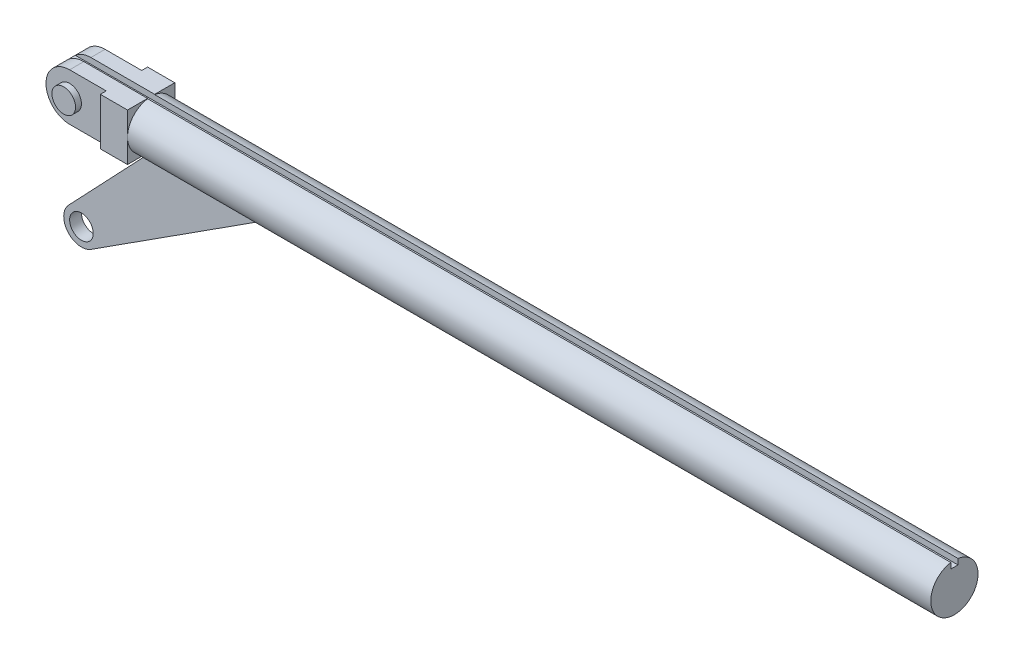
ISO-10303-21;
HEADER;
FILE_DESCRIPTION(('STEP AP214'),'2;1');
FILE_NAME('part.step','',(''),(''),'','','');
FILE_SCHEMA(('AUTOMOTIVE_DESIGN { 1 0 10303 214 1 1 1 1 }'));
ENDSEC;
DATA;
#1=APPLICATION_CONTEXT('core data for automotive mechanical design processes');
#2=APPLICATION_PROTOCOL_DEFINITION('international standard','automotive_design',2000,#1);
#3=PRODUCT_CONTEXT('',#1,'mechanical');
#4=PRODUCT('Part','Part','',(#3));
#5=PRODUCT_RELATED_PRODUCT_CATEGORY('part','',(#4));
#6=PRODUCT_DEFINITION_FORMATION('','',#4);
#7=PRODUCT_DEFINITION_CONTEXT('part definition',#1,'design');
#8=PRODUCT_DEFINITION('design','',#6,#7);
#9=PRODUCT_DEFINITION_SHAPE('','',#8);
#10=(LENGTH_UNIT() NAMED_UNIT(*) SI_UNIT(.MILLI.,.METRE.));
#11=(NAMED_UNIT(*) PLANE_ANGLE_UNIT() SI_UNIT($,.RADIAN.));
#12=(NAMED_UNIT(*) SI_UNIT($,.STERADIAN.) SOLID_ANGLE_UNIT());
#13=UNCERTAINTY_MEASURE_WITH_UNIT(LENGTH_MEASURE(1.E-05),#10,'distance_accuracy_value','');
#14=(GEOMETRIC_REPRESENTATION_CONTEXT(3) GLOBAL_UNCERTAINTY_ASSIGNED_CONTEXT((#13)) GLOBAL_UNIT_ASSIGNED_CONTEXT((#10,
#11,#12)) REPRESENTATION_CONTEXT('',''));
#15=CARTESIAN_POINT('',(0.,0.,0.));
#16=DIRECTION('',(0.,0.,1.));
#17=DIRECTION('',(1.,0.,0.));
#18=AXIS2_PLACEMENT_3D('',#15,#16,#17);
#19=CARTESIAN_POINT('',(-68.,0.,0.));
#20=DIRECTION('',(1.,0.,0.));
#21=DIRECTION('',(0.,0.,-1.));
#22=AXIS2_PLACEMENT_3D('',#19,#20,#21);
#23=CYLINDRICAL_SURFACE('',#22,2.);
#24=DIRECTION('',(1.,0.,0.));
#25=VECTOR('',#24,1.);
#26=CARTESIAN_POINT('',(-68.,1.97737199332852,-0.3));
#27=LINE('',#26,#25);
#28=CARTESIAN_POINT('',(0.,1.97737199332852,-0.3));
#29=VERTEX_POINT('',#28);
#30=CARTESIAN_POINT('',(-68.,1.97737199332852,-0.3));
#31=VERTEX_POINT('',#30);
#32=EDGE_CURVE('E216',#29,#31,#27,.F.);
#33=ORIENTED_EDGE('',*,*,#32,.F.);
#34=CARTESIAN_POINT('',(0.,0.,0.));
#35=DIRECTION('',(1.,0.,0.));
#36=DIRECTION('',(0.,0.,-1.));
#37=AXIS2_PLACEMENT_3D('',#34,#35,#36);
#38=CIRCLE('',#37,2.);
#39=CARTESIAN_POINT('',(0.,1.97737199332852,0.3));
#40=VERTEX_POINT('',#39);
#41=EDGE_CURVE('E297',#40,#29,#38,.T.);
#42=ORIENTED_EDGE('',*,*,#41,.F.);
#43=DIRECTION('',(1.,0.,0.));
#44=VECTOR('',#43,1.);
#45=CARTESIAN_POINT('',(-68.,1.97737199332852,0.3));
#46=LINE('',#45,#44);
#47=CARTESIAN_POINT('',(-68.,1.97737199332852,0.3));
#48=VERTEX_POINT('',#47);
#49=EDGE_CURVE('E211',#48,#40,#46,.T.);
#50=ORIENTED_EDGE('',*,*,#49,.F.);
#51=CARTESIAN_POINT('',(-68.,0.,0.));
#52=DIRECTION('',(1.,0.,0.));
#53=DIRECTION('',(0.,0.,-1.));
#54=AXIS2_PLACEMENT_3D('',#51,#52,#53);
#55=CIRCLE('',#54,2.);
#56=CARTESIAN_POINT('',(-68.,0.,2.));
#57=VERTEX_POINT('',#56);
#58=EDGE_CURVE('E301',#48,#57,#55,.T.);
#59=ORIENTED_EDGE('',*,*,#58,.T.);
#60=CARTESIAN_POINT('',(-68.,-2.,0.));
#61=VERTEX_POINT('',#60);
#62=EDGE_CURVE('E302',#57,#61,#55,.T.);
#63=ORIENTED_EDGE('',*,*,#62,.T.);
#64=CARTESIAN_POINT('',(-68.,0.,-2.));
#65=VERTEX_POINT('',#64);
#66=EDGE_CURVE('E305',#61,#65,#55,.T.);
#67=ORIENTED_EDGE('',*,*,#66,.T.);
#68=EDGE_CURVE('E298',#65,#31,#55,.T.);
#69=ORIENTED_EDGE('',*,*,#68,.T.);
#70=EDGE_LOOP('',(#33,#42,#50,#59,#63,#67,#69));
#71=FACE_BOUND('',#70,.T.);
#72=DIRECTION('',(1.,0.,0.));
#73=VECTOR('',#72,1.);
#74=CARTESIAN_POINT('',(-68.,-1.93649167310371,-0.5));
#75=LINE('',#74,#73);
#76=CARTESIAN_POINT('',(-67.8143144366733,-1.93649167310371,-0.5));
#77=VERTEX_POINT('',#76);
#78=CARTESIAN_POINT('',(-58.0791610574688,-1.93649167310371,-0.5));
#79=VERTEX_POINT('',#78);
#80=EDGE_CURVE('E318',#77,#79,#75,.T.);
#81=ORIENTED_EDGE('',*,*,#80,.F.);
#82=CARTESIAN_POINT('',(-65.9762118883254,0.,0.));
#83=DIRECTION('',(0.725291974119072,-0.688441393495815,0.));
#84=DIRECTION('',(0.688441393495815,0.725291974119072,0.));
#85=AXIS2_PLACEMENT_3D('',#82,#83,#84);
#86=ELLIPSE('',#85,2.75751017709684,2.);
#87=CARTESIAN_POINT('',(-67.8143144366733,-1.93649167310371,0.5));
#88=VERTEX_POINT('',#87);
#89=EDGE_CURVE('E11',#77,#88,#86,.F.);
#90=ORIENTED_EDGE('',*,*,#89,.T.);
#91=DIRECTION('',(1.,0.,0.));
#92=VECTOR('',#91,1.);
#93=CARTESIAN_POINT('',(-68.,-1.93649167310371,0.5));
#94=LINE('',#93,#92);
#95=CARTESIAN_POINT('',(-58.0791610574688,-1.93649167310371,0.5));
#96=VERTEX_POINT('',#95);
#97=EDGE_CURVE('E41',#88,#96,#94,.T.);
#98=ORIENTED_EDGE('',*,*,#97,.T.);
#99=CARTESIAN_POINT('',(-55.0660686813122,0.,0.));
#100=DIRECTION('',(-0.540659545239226,0.841241496920898,0.));
#101=DIRECTION('',(0.841241496920898,0.540659545239227,0.));
#102=AXIS2_PLACEMENT_3D('',#99,#100,#101);
#103=ELLIPSE('',#102,3.69918559213647,2.);
#104=EDGE_CURVE('E315',#96,#79,#103,.F.);
#105=ORIENTED_EDGE('',*,*,#104,.T.);
#106=EDGE_LOOP('',(#81,#90,#98,#105));
#107=FACE_BOUND('',#106,.T.);
#108=ADVANCED_FACE('F34',(#71,#107),#23,.T.);
#109=CARTESIAN_POINT('',(-68.,2.,2.));
#110=DIRECTION('',(0.,-1.,0.));
#111=DIRECTION('',(1.,0.,0.));
#112=AXIS2_PLACEMENT_3D('',#109,#110,#111);
#113=PLANE('',#112);
#114=DIRECTION('',(0.,0.,-1.));
#115=VECTOR('',#114,1.);
#116=CARTESIAN_POINT('',(-73.4,2.,2.));
#117=LINE('',#116,#115);
#118=CARTESIAN_POINT('',(-73.4,2.,-0.3));
#119=VERTEX_POINT('',#118);
#120=CARTESIAN_POINT('',(-73.4,2.,-1.5));
#121=VERTEX_POINT('',#120);
#122=EDGE_CURVE('E289',#119,#121,#117,.T.);
#123=ORIENTED_EDGE('',*,*,#122,.F.);
#124=DIRECTION('',(-1.,0.,0.));
#125=VECTOR('',#124,1.);
#126=CARTESIAN_POINT('',(-75.4,2.,-0.3));
#127=LINE('',#126,#125);
#128=CARTESIAN_POINT('',(-68.,2.,-0.3));
#129=VERTEX_POINT('',#128);
#130=EDGE_CURVE('E192',#129,#119,#127,.T.);
#131=ORIENTED_EDGE('',*,*,#130,.F.);
#132=DIRECTION('',(0.,0.,-1.));
#133=VECTOR('',#132,1.);
#134=CARTESIAN_POINT('',(-68.,2.,2.));
#135=LINE('',#134,#133);
#136=CARTESIAN_POINT('',(-68.,2.,-2.));
#137=VERTEX_POINT('',#136);
#138=EDGE_CURVE('E293',#129,#137,#135,.T.);
#139=ORIENTED_EDGE('',*,*,#138,.T.);
#140=DIRECTION('',(-1.,0.,0.));
#141=VECTOR('',#140,1.);
#142=CARTESIAN_POINT('',(-68.,2.,-2.));
#143=LINE('',#142,#141);
#144=CARTESIAN_POINT('',(-70.3,2.,-2.));
#145=VERTEX_POINT('',#144);
#146=EDGE_CURVE('E278',#137,#145,#143,.T.);
#147=ORIENTED_EDGE('',*,*,#146,.T.);
#148=DIRECTION('',(0.,0.,-1.));
#149=VECTOR('',#148,1.);
#150=CARTESIAN_POINT('',(-70.3,2.,-2.));
#151=LINE('',#150,#149);
#152=CARTESIAN_POINT('',(-70.3,2.,-1.5));
#153=VERTEX_POINT('',#152);
#154=EDGE_CURVE('E232',#153,#145,#151,.T.);
#155=ORIENTED_EDGE('',*,*,#154,.F.);
#156=DIRECTION('',(1.,0.,0.));
#157=VECTOR('',#156,1.);
#158=CARTESIAN_POINT('',(-75.4,2.,-1.5));
#159=LINE('',#158,#157);
#160=EDGE_CURVE('E230',#121,#153,#159,.T.);
#161=ORIENTED_EDGE('',*,*,#160,.F.);
#162=EDGE_LOOP('',(#123,#131,#139,#147,#155,#161));
#163=FACE_BOUND('',#162,.T.);
#164=ADVANCED_FACE('F347',(#163),#113,.F.);
#165=CARTESIAN_POINT('',(0.,0.,0.));
#166=DIRECTION('',(1.,0.,0.));
#167=DIRECTION('',(0.,0.,-1.));
#168=AXIS2_PLACEMENT_3D('',#165,#166,#167);
#169=PLANE('',#168);
#170=DIRECTION('',(0.,1.,0.));
#171=VECTOR('',#170,1.);
#172=CARTESIAN_POINT('',(0.,1.50000000000001,-0.3));
#173=LINE('',#172,#171);
#174=CARTESIAN_POINT('',(0.,1.50000000000001,-0.3));
#175=VERTEX_POINT('',#174);
#176=EDGE_CURVE('E204',#175,#29,#173,.T.);
#177=ORIENTED_EDGE('',*,*,#176,.F.);
#178=DIRECTION('',(0.,0.,-1.));
#179=VECTOR('',#178,1.);
#180=CARTESIAN_POINT('',(0.,1.50000000000001,-0.3));
#181=LINE('',#180,#179);
#182=CARTESIAN_POINT('',(0.,1.50000000000001,0.3));
#183=VERTEX_POINT('',#182);
#184=EDGE_CURVE('E199',#183,#175,#181,.T.);
#185=ORIENTED_EDGE('',*,*,#184,.F.);
#186=DIRECTION('',(0.,1.,0.));
#187=VECTOR('',#186,1.);
#188=CARTESIAN_POINT('',(0.,1.50000000000001,0.3));
#189=LINE('',#188,#187);
#190=EDGE_CURVE('E201',#183,#40,#189,.T.);
#191=ORIENTED_EDGE('',*,*,#190,.T.);
#192=ORIENTED_EDGE('',*,*,#41,.T.);
#193=EDGE_LOOP('',(#177,#185,#191,#192));
#194=FACE_BOUND('',#193,.T.);
#195=ADVANCED_FACE('F354',(#194),#169,.T.);
#196=CARTESIAN_POINT('',(-68.,2.,2.));
#197=DIRECTION('',(-1.,0.,0.));
#198=DIRECTION('',(0.,0.,1.));
#199=AXIS2_PLACEMENT_3D('',#196,#197,#198);
#200=PLANE('',#199);
#201=ORIENTED_EDGE('',*,*,#138,.F.);
#202=DIRECTION('',(0.,-1.,0.));
#203=VECTOR('',#202,1.);
#204=CARTESIAN_POINT('',(-68.,2.,-0.3));
#205=LINE('',#204,#203);
#206=EDGE_CURVE('E213',#129,#31,#205,.T.);
#207=ORIENTED_EDGE('',*,*,#206,.T.);
#208=ORIENTED_EDGE('',*,*,#68,.F.);
#209=DIRECTION('',(0.,1.,0.));
#210=VECTOR('',#209,1.);
#211=CARTESIAN_POINT('',(-68.,2.,-2.));
#212=LINE('',#211,#210);
#213=EDGE_CURVE('E265',#65,#137,#212,.T.);
#214=ORIENTED_EDGE('',*,*,#213,.T.);
#215=EDGE_LOOP('',(#201,#207,#208,#214));
#216=FACE_BOUND('',#215,.T.);
#217=ADVANCED_FACE('F425',(#216),#200,.F.);
#218=ORIENTED_EDGE('',*,*,#58,.F.);
#219=DIRECTION('',(0.,1.,0.));
#220=VECTOR('',#219,1.);
#221=CARTESIAN_POINT('',(-68.,2.,0.3));
#222=LINE('',#221,#220);
#223=CARTESIAN_POINT('',(-68.,2.,0.3));
#224=VERTEX_POINT('',#223);
#225=EDGE_CURVE('E206',#48,#224,#222,.T.);
#226=ORIENTED_EDGE('',*,*,#225,.T.);
#227=CARTESIAN_POINT('',(-68.,2.,2.));
#228=VERTEX_POINT('',#227);
#229=EDGE_CURVE('E294',#228,#224,#135,.T.);
#230=ORIENTED_EDGE('',*,*,#229,.F.);
#231=DIRECTION('',(0.,1.,0.));
#232=VECTOR('',#231,1.);
#233=CARTESIAN_POINT('',(-68.,2.,2.));
#234=LINE('',#233,#232);
#235=EDGE_CURVE('E270',#57,#228,#234,.T.);
#236=ORIENTED_EDGE('',*,*,#235,.F.);
#237=EDGE_LOOP('',(#218,#226,#230,#236));
#238=FACE_BOUND('',#237,.T.);
#239=ADVANCED_FACE('F376',(#238),#200,.F.);
#240=ORIENTED_EDGE('',*,*,#62,.F.);
#241=CARTESIAN_POINT('',(-68.,-2.,2.));
#242=VERTEX_POINT('',#241);
#243=EDGE_CURVE('E266',#242,#57,#234,.T.);
#244=ORIENTED_EDGE('',*,*,#243,.F.);
#245=DIRECTION('',(0.,0.,-1.));
#246=VECTOR('',#245,1.);
#247=CARTESIAN_POINT('',(-68.,-2.,2.));
#248=LINE('',#247,#246);
#249=EDGE_CURVE('E283',#242,#61,#248,.T.);
#250=ORIENTED_EDGE('',*,*,#249,.T.);
#251=EDGE_LOOP('',(#240,#244,#250));
#252=FACE_BOUND('',#251,.T.);
#253=ADVANCED_FACE('F391',(#252),#200,.F.);
#254=ORIENTED_EDGE('',*,*,#66,.F.);
#255=CARTESIAN_POINT('',(-68.,-2.,-2.));
#256=VERTEX_POINT('',#255);
#257=EDGE_CURVE('E275',#61,#256,#248,.T.);
#258=ORIENTED_EDGE('',*,*,#257,.T.);
#259=EDGE_CURVE('E276',#256,#65,#212,.T.);
#260=ORIENTED_EDGE('',*,*,#259,.T.);
#261=EDGE_LOOP('',(#254,#258,#260));
#262=FACE_BOUND('',#261,.T.);
#263=ADVANCED_FACE('F381',(#262),#200,.F.);
#264=ORIENTED_EDGE('',*,*,#229,.T.);
#265=DIRECTION('',(1.,0.,0.));
#266=VECTOR('',#265,1.);
#267=CARTESIAN_POINT('',(-75.4,2.,0.3));
#268=LINE('',#267,#266);
#269=CARTESIAN_POINT('',(-73.4,2.,0.3));
#270=VERTEX_POINT('',#269);
#271=EDGE_CURVE('E190',#270,#224,#268,.T.);
#272=ORIENTED_EDGE('',*,*,#271,.F.);
#273=CARTESIAN_POINT('',(-73.4,2.,1.5));
#274=VERTEX_POINT('',#273);
#275=EDGE_CURVE('E290',#274,#270,#117,.T.);
#276=ORIENTED_EDGE('',*,*,#275,.F.);
#277=DIRECTION('',(-1.,0.,0.));
#278=VECTOR('',#277,1.);
#279=CARTESIAN_POINT('',(-75.4,2.,1.5));
#280=LINE('',#279,#278);
#281=CARTESIAN_POINT('',(-70.3,2.,1.5));
#282=VERTEX_POINT('',#281);
#283=EDGE_CURVE('E250',#282,#274,#280,.T.);
#284=ORIENTED_EDGE('',*,*,#283,.F.);
#285=DIRECTION('',(0.,0.,-1.));
#286=VECTOR('',#285,1.);
#287=CARTESIAN_POINT('',(-70.3,2.,2.));
#288=LINE('',#287,#286);
#289=CARTESIAN_POINT('',(-70.3,2.,2.));
#290=VERTEX_POINT('',#289);
#291=EDGE_CURVE('E222',#290,#282,#288,.T.);
#292=ORIENTED_EDGE('',*,*,#291,.F.);
#293=DIRECTION('',(-1.,0.,0.));
#294=VECTOR('',#293,1.);
#295=CARTESIAN_POINT('',(-68.,2.,2.));
#296=LINE('',#295,#294);
#297=EDGE_CURVE('E269',#228,#290,#296,.T.);
#298=ORIENTED_EDGE('',*,*,#297,.F.);
#299=EDGE_LOOP('',(#264,#272,#276,#284,#292,#298));
#300=FACE_BOUND('',#299,.T.);
#301=ADVANCED_FACE('F357',(#300),#113,.F.);
#302=CARTESIAN_POINT('',(-73.4,0.,2.));
#303=DIRECTION('',(0.,0.,-1.));
#304=DIRECTION('',(-1.,0.,0.));
#305=AXIS2_PLACEMENT_3D('',#302,#303,#304);
#306=CYLINDRICAL_SURFACE('',#305,2.);
#307=DIRECTION('',(0.,0.,-1.));
#308=VECTOR('',#307,1.);
#309=CARTESIAN_POINT('',(-74.7228756555323,1.5,2.));
#310=LINE('',#309,#308);
#311=CARTESIAN_POINT('',(-74.7228756555323,1.5,-0.3));
#312=VERTEX_POINT('',#311);
#313=CARTESIAN_POINT('',(-74.7228756555323,1.5,0.3));
#314=VERTEX_POINT('',#313);
#315=EDGE_CURVE('E228',#312,#314,#310,.F.);
#316=ORIENTED_EDGE('',*,*,#315,.F.);
#317=CARTESIAN_POINT('',(-73.4,0.,-0.3));
#318=DIRECTION('',(0.,0.,-1.));
#319=DIRECTION('',(-1.,0.,0.));
#320=AXIS2_PLACEMENT_3D('',#317,#318,#319);
#321=CIRCLE('',#320,2.);
#322=EDGE_CURVE('E312',#312,#119,#321,.T.);
#323=ORIENTED_EDGE('',*,*,#322,.T.);
#324=ORIENTED_EDGE('',*,*,#122,.T.);
#325=CARTESIAN_POINT('',(-73.4,0.,-1.5));
#326=DIRECTION('',(0.,0.,1.));
#327=DIRECTION('',(1.,0.,0.));
#328=AXIS2_PLACEMENT_3D('',#325,#326,#327);
#329=CIRCLE('',#328,2.);
#330=CARTESIAN_POINT('',(-73.4,-2.,-1.5));
#331=VERTEX_POINT('',#330);
#332=EDGE_CURVE('E263',#121,#331,#329,.T.);
#333=ORIENTED_EDGE('',*,*,#332,.T.);
#334=DIRECTION('',(0.,0.,-1.));
#335=VECTOR('',#334,1.);
#336=CARTESIAN_POINT('',(-73.4,-2.,2.));
#337=LINE('',#336,#335);
#338=CARTESIAN_POINT('',(-73.4,-2.,1.5));
#339=VERTEX_POINT('',#338);
#340=EDGE_CURVE('E286',#339,#331,#337,.T.);
#341=ORIENTED_EDGE('',*,*,#340,.F.);
#342=CARTESIAN_POINT('',(-73.4,0.,1.5));
#343=DIRECTION('',(0.,0.,-1.));
#344=DIRECTION('',(-1.,0.,0.));
#345=AXIS2_PLACEMENT_3D('',#342,#343,#344);
#346=CIRCLE('',#345,2.);
#347=EDGE_CURVE('E245',#339,#274,#346,.T.);
#348=ORIENTED_EDGE('',*,*,#347,.T.);
#349=ORIENTED_EDGE('',*,*,#275,.T.);
#350=CARTESIAN_POINT('',(-73.4,0.,0.3));
#351=DIRECTION('',(0.,0.,1.));
#352=DIRECTION('',(1.,0.,0.));
#353=AXIS2_PLACEMENT_3D('',#350,#351,#352);
#354=CIRCLE('',#353,2.);
#355=EDGE_CURVE('E309',#270,#314,#354,.T.);
#356=ORIENTED_EDGE('',*,*,#355,.T.);
#357=EDGE_LOOP('',(#316,#323,#324,#333,#341,#348,#349,#356));
#358=FACE_BOUND('',#357,.T.);
#359=ADVANCED_FACE('F407',(#358),#306,.T.);
#360=CARTESIAN_POINT('',(-68.,-2.,2.));
#361=DIRECTION('',(0.,1.,0.));
#362=DIRECTION('',(-1.,0.,0.));
#363=AXIS2_PLACEMENT_3D('',#360,#361,#362);
#364=PLANE('',#363);
#365=DIRECTION('',(1.,0.,0.));
#366=VECTOR('',#365,1.);
#367=CARTESIAN_POINT('',(-75.4,-2.,-1.5));
#368=LINE('',#367,#366);
#369=CARTESIAN_POINT('',(-70.3,-2.,-1.5));
#370=VERTEX_POINT('',#369);
#371=EDGE_CURVE('E235',#331,#370,#368,.T.);
#372=ORIENTED_EDGE('',*,*,#371,.T.);
#373=DIRECTION('',(0.,0.,-1.));
#374=VECTOR('',#373,1.);
#375=CARTESIAN_POINT('',(-70.3,-2.,-2.));
#376=LINE('',#375,#374);
#377=CARTESIAN_POINT('',(-70.3,-2.,-2.));
#378=VERTEX_POINT('',#377);
#379=EDGE_CURVE('E238',#370,#378,#376,.T.);
#380=ORIENTED_EDGE('',*,*,#379,.T.);
#381=DIRECTION('',(1.,0.,0.));
#382=VECTOR('',#381,1.);
#383=CARTESIAN_POINT('',(-68.,-2.,-2.));
#384=LINE('',#383,#382);
#385=EDGE_CURVE('E281',#378,#256,#384,.T.);
#386=ORIENTED_EDGE('',*,*,#385,.T.);
#387=ORIENTED_EDGE('',*,*,#257,.F.);
#388=ORIENTED_EDGE('',*,*,#249,.F.);
#389=DIRECTION('',(1.,0.,0.));
#390=VECTOR('',#389,1.);
#391=CARTESIAN_POINT('',(-68.,-2.,2.));
#392=LINE('',#391,#390);
#393=CARTESIAN_POINT('',(-70.3,-2.,2.));
#394=VERTEX_POINT('',#393);
#395=EDGE_CURVE('E273',#394,#242,#392,.T.);
#396=ORIENTED_EDGE('',*,*,#395,.F.);
#397=DIRECTION('',(0.,0.,-1.));
#398=VECTOR('',#397,1.);
#399=CARTESIAN_POINT('',(-70.3,-2.,2.));
#400=LINE('',#399,#398);
#401=CARTESIAN_POINT('',(-70.3,-2.,1.5));
#402=VERTEX_POINT('',#401);
#403=EDGE_CURVE('E253',#394,#402,#400,.T.);
#404=ORIENTED_EDGE('',*,*,#403,.T.);
#405=DIRECTION('',(-1.,0.,0.));
#406=VECTOR('',#405,1.);
#407=CARTESIAN_POINT('',(-75.4,-2.,1.5));
#408=LINE('',#407,#406);
#409=EDGE_CURVE('E256',#402,#339,#408,.T.);
#410=ORIENTED_EDGE('',*,*,#409,.T.);
#411=ORIENTED_EDGE('',*,*,#340,.T.);
#412=EDGE_LOOP('',(#372,#380,#386,#387,#388,#396,#404,#410,#411));
#413=FACE_BOUND('',#412,.T.);
#414=ADVANCED_FACE('F386',(#413),#364,.F.);
#415=CARTESIAN_POINT('',(-73.4,0.,2.));
#416=DIRECTION('',(0.,0.,1.));
#417=DIRECTION('',(1.,0.,0.));
#418=AXIS2_PLACEMENT_3D('',#415,#416,#417);
#419=PLANE('',#418);
#420=DIRECTION('',(0.,1.,0.));
#421=VECTOR('',#420,1.);
#422=CARTESIAN_POINT('',(-70.3,-2.,2.));
#423=LINE('',#422,#421);
#424=EDGE_CURVE('E259',#394,#290,#423,.T.);
#425=ORIENTED_EDGE('',*,*,#424,.F.);
#426=ORIENTED_EDGE('',*,*,#395,.T.);
#427=ORIENTED_EDGE('',*,*,#243,.T.);
#428=ORIENTED_EDGE('',*,*,#235,.T.);
#429=ORIENTED_EDGE('',*,*,#297,.T.);
#430=EDGE_LOOP('',(#425,#426,#427,#428,#429));
#431=FACE_BOUND('',#430,.T.);
#432=ADVANCED_FACE('F394',(#431),#419,.T.);
#433=CARTESIAN_POINT('',(-73.4,0.,-2.));
#434=DIRECTION('',(0.,0.,1.));
#435=DIRECTION('',(1.,0.,0.));
#436=AXIS2_PLACEMENT_3D('',#433,#434,#435);
#437=PLANE('',#436);
#438=ORIENTED_EDGE('',*,*,#385,.F.);
#439=DIRECTION('',(0.,1.,0.));
#440=VECTOR('',#439,1.);
#441=CARTESIAN_POINT('',(-70.3,-2.,-2.));
#442=LINE('',#441,#440);
#443=EDGE_CURVE('E242',#378,#145,#442,.T.);
#444=ORIENTED_EDGE('',*,*,#443,.T.);
#445=ORIENTED_EDGE('',*,*,#146,.F.);
#446=ORIENTED_EDGE('',*,*,#213,.F.);
#447=ORIENTED_EDGE('',*,*,#259,.F.);
#448=EDGE_LOOP('',(#438,#444,#445,#446,#447));
#449=FACE_BOUND('',#448,.T.);
#450=ADVANCED_FACE('F419',(#449),#437,.F.);
#451=CARTESIAN_POINT('',(-75.4,-2.,-1.5));
#452=DIRECTION('',(0.,0.,1.));
#453=DIRECTION('',(1.,0.,0.));
#454=AXIS2_PLACEMENT_3D('',#451,#452,#453);
#455=PLANE('',#454);
#456=CARTESIAN_POINT('',(-73.4,0.,-1.5));
#457=DIRECTION('',(0.,0.,1.));
#458=DIRECTION('',(1.,0.,0.));
#459=AXIS2_PLACEMENT_3D('',#456,#457,#458);
#460=CIRCLE('',#459,0.999999999999998);
#461=CARTESIAN_POINT('',(-72.4,0.,-1.5));
#462=VERTEX_POINT('',#461);
#463=EDGE_CURVE('E225',#462,#462,#460,.F.);
#464=ORIENTED_EDGE('',*,*,#463,.F.);
#465=EDGE_LOOP('',(#464));
#466=FACE_BOUND('',#465,.T.);
#467=ORIENTED_EDGE('',*,*,#160,.T.);
#468=DIRECTION('',(0.,1.,0.));
#469=VECTOR('',#468,1.);
#470=CARTESIAN_POINT('',(-70.3,-2.,-1.5));
#471=LINE('',#470,#469);
#472=EDGE_CURVE('E241',#370,#153,#471,.T.);
#473=ORIENTED_EDGE('',*,*,#472,.F.);
#474=ORIENTED_EDGE('',*,*,#371,.F.);
#475=ORIENTED_EDGE('',*,*,#332,.F.);
#476=EDGE_LOOP('',(#467,#473,#474,#475));
#477=FACE_BOUND('',#476,.T.);
#478=ADVANCED_FACE('F412',(#466,#477),#455,.F.);
#479=CARTESIAN_POINT('',(-70.3,-2.,-2.));
#480=DIRECTION('',(1.,0.,0.));
#481=DIRECTION('',(0.,0.,-1.));
#482=AXIS2_PLACEMENT_3D('',#479,#480,#481);
#483=PLANE('',#482);
#484=ORIENTED_EDGE('',*,*,#443,.F.);
#485=ORIENTED_EDGE('',*,*,#379,.F.);
#486=ORIENTED_EDGE('',*,*,#472,.T.);
#487=ORIENTED_EDGE('',*,*,#154,.T.);
#488=EDGE_LOOP('',(#484,#485,#486,#487));
#489=FACE_BOUND('',#488,.T.);
#490=ADVANCED_FACE('F416',(#489),#483,.F.);
#491=CARTESIAN_POINT('',(-75.4,-2.,1.5));
#492=DIRECTION('',(0.,0.,-1.));
#493=DIRECTION('',(-1.,0.,0.));
#494=AXIS2_PLACEMENT_3D('',#491,#492,#493);
#495=PLANE('',#494);
#496=CARTESIAN_POINT('',(-73.4,0.,1.5));
#497=DIRECTION('',(0.,0.,-1.));
#498=DIRECTION('',(-1.,0.,0.));
#499=AXIS2_PLACEMENT_3D('',#496,#497,#498);
#500=CIRCLE('',#499,0.999999999999998);
#501=CARTESIAN_POINT('',(-74.4,0.,1.5));
#502=VERTEX_POINT('',#501);
#503=EDGE_CURVE('E229',#502,#502,#500,.F.);
#504=ORIENTED_EDGE('',*,*,#503,.F.);
#505=EDGE_LOOP('',(#504));
#506=FACE_BOUND('',#505,.T.);
#507=ORIENTED_EDGE('',*,*,#347,.F.);
#508=ORIENTED_EDGE('',*,*,#409,.F.);
#509=DIRECTION('',(0.,1.,0.));
#510=VECTOR('',#509,1.);
#511=CARTESIAN_POINT('',(-70.3,-2.,1.5));
#512=LINE('',#511,#510);
#513=EDGE_CURVE('E233',#402,#282,#512,.T.);
#514=ORIENTED_EDGE('',*,*,#513,.T.);
#515=ORIENTED_EDGE('',*,*,#283,.T.);
#516=EDGE_LOOP('',(#507,#508,#514,#515));
#517=FACE_BOUND('',#516,.T.);
#518=ADVANCED_FACE('F403',(#506,#517),#495,.F.);
#519=CARTESIAN_POINT('',(-70.3,-2.,2.));
#520=DIRECTION('',(1.,0.,0.));
#521=DIRECTION('',(0.,0.,-1.));
#522=AXIS2_PLACEMENT_3D('',#519,#520,#521);
#523=PLANE('',#522);
#524=ORIENTED_EDGE('',*,*,#513,.F.);
#525=ORIENTED_EDGE('',*,*,#403,.F.);
#526=ORIENTED_EDGE('',*,*,#424,.T.);
#527=ORIENTED_EDGE('',*,*,#291,.T.);
#528=EDGE_LOOP('',(#524,#525,#526,#527));
#529=FACE_BOUND('',#528,.T.);
#530=ADVANCED_FACE('F399',(#529),#523,.F.);
#531=CARTESIAN_POINT('',(-73.4,0.,2.));
#532=DIRECTION('',(0.,0.,1.));
#533=DIRECTION('',(1.,0.,0.));
#534=AXIS2_PLACEMENT_3D('',#531,#532,#533);
#535=PLANE('',#534);
#536=CARTESIAN_POINT('',(-73.4,0.,2.));
#537=DIRECTION('',(0.,0.,1.));
#538=DIRECTION('',(1.,0.,0.));
#539=AXIS2_PLACEMENT_3D('',#536,#537,#538);
#540=CIRCLE('',#539,0.999999999999998);
#541=CARTESIAN_POINT('',(-72.4,0.,2.));
#542=VERTEX_POINT('',#541);
#543=EDGE_CURVE('E219',#542,#542,#540,.T.);
#544=ORIENTED_EDGE('',*,*,#543,.T.);
#545=EDGE_LOOP('',(#544));
#546=FACE_BOUND('',#545,.T.);
#547=ADVANCED_FACE('F440',(#546),#535,.T.);
#548=CARTESIAN_POINT('',(-73.4,0.,2.));
#549=DIRECTION('',(0.,0.,-1.));
#550=DIRECTION('',(-1.,0.,0.));
#551=AXIS2_PLACEMENT_3D('',#548,#549,#550);
#552=CYLINDRICAL_SURFACE('',#551,0.999999999999998);
#553=ORIENTED_EDGE('',*,*,#543,.F.);
#554=EDGE_LOOP('',(#553));
#555=FACE_BOUND('',#554,.T.);
#556=ORIENTED_EDGE('',*,*,#503,.T.);
#557=EDGE_LOOP('',(#556));
#558=FACE_BOUND('',#557,.T.);
#559=ADVANCED_FACE('F443',(#555,#558),#552,.T.);
#560=CARTESIAN_POINT('',(-73.4,0.,-2.));
#561=DIRECTION('',(0.,0.,1.));
#562=DIRECTION('',(1.,0.,0.));
#563=AXIS2_PLACEMENT_3D('',#560,#561,#562);
#564=CIRCLE('',#563,0.999999999999998);
#565=CARTESIAN_POINT('',(-72.4,0.,-2.));
#566=VERTEX_POINT('',#565);
#567=EDGE_CURVE('E218',#566,#566,#564,.T.);
#568=ORIENTED_EDGE('',*,*,#567,.T.);
#569=EDGE_LOOP('',(#568));
#570=FACE_BOUND('',#569,.T.);
#571=ORIENTED_EDGE('',*,*,#463,.T.);
#572=EDGE_LOOP('',(#571));
#573=FACE_BOUND('',#572,.T.);
#574=ADVANCED_FACE('F447',(#570,#573),#552,.T.);
#575=CARTESIAN_POINT('',(-73.4,0.,-2.));
#576=DIRECTION('',(0.,0.,1.));
#577=DIRECTION('',(1.,0.,0.));
#578=AXIS2_PLACEMENT_3D('',#575,#576,#577);
#579=PLANE('',#578);
#580=ORIENTED_EDGE('',*,*,#567,.F.);
#581=EDGE_LOOP('',(#580));
#582=FACE_BOUND('',#581,.T.);
#583=ADVANCED_FACE('F438',(#582),#579,.F.);
#584=CARTESIAN_POINT('',(-75.4,1.5,-0.3));
#585=DIRECTION('',(0.,0.,-1.));
#586=DIRECTION('',(-1.,0.,0.));
#587=AXIS2_PLACEMENT_3D('',#584,#585,#586);
#588=PLANE('',#587);
#589=ORIENTED_EDGE('',*,*,#32,.T.);
#590=ORIENTED_EDGE('',*,*,#206,.F.);
#591=ORIENTED_EDGE('',*,*,#130,.T.);
#592=ORIENTED_EDGE('',*,*,#322,.F.);
#593=DIRECTION('',(-1.,0.,0.));
#594=VECTOR('',#593,1.);
#595=CARTESIAN_POINT('',(-75.4,1.5,-0.3));
#596=LINE('',#595,#594);
#597=EDGE_CURVE('E56',#175,#312,#596,.T.);
#598=ORIENTED_EDGE('',*,*,#597,.F.);
#599=ORIENTED_EDGE('',*,*,#176,.T.);
#600=EDGE_LOOP('',(#589,#590,#591,#592,#598,#599));
#601=FACE_BOUND('',#600,.T.);
#602=ADVANCED_FACE('F426',(#601),#588,.F.);
#603=CARTESIAN_POINT('',(-75.4,1.5,0.3));
#604=DIRECTION('',(0.,0.,1.));
#605=DIRECTION('',(1.,0.,0.));
#606=AXIS2_PLACEMENT_3D('',#603,#604,#605);
#607=PLANE('',#606);
#608=ORIENTED_EDGE('',*,*,#49,.T.);
#609=ORIENTED_EDGE('',*,*,#190,.F.);
#610=DIRECTION('',(1.,0.,0.));
#611=VECTOR('',#610,1.);
#612=CARTESIAN_POINT('',(-75.4,1.5,0.3));
#613=LINE('',#612,#611);
#614=EDGE_CURVE('E197',#314,#183,#613,.T.);
#615=ORIENTED_EDGE('',*,*,#614,.F.);
#616=ORIENTED_EDGE('',*,*,#355,.F.);
#617=ORIENTED_EDGE('',*,*,#271,.T.);
#618=ORIENTED_EDGE('',*,*,#225,.F.);
#619=EDGE_LOOP('',(#608,#609,#615,#616,#617,#618));
#620=FACE_BOUND('',#619,.T.);
#621=ADVANCED_FACE('F370',(#620),#607,.F.);
#622=CARTESIAN_POINT('',(0.,1.50000000000001,0.));
#623=DIRECTION('',(0.,1.,0.));
#624=DIRECTION('',(-1.,0.,0.));
#625=AXIS2_PLACEMENT_3D('',#622,#623,#624);
#626=PLANE('',#625);
#627=ORIENTED_EDGE('',*,*,#315,.T.);
#628=ORIENTED_EDGE('',*,*,#614,.T.);
#629=ORIENTED_EDGE('',*,*,#184,.T.);
#630=ORIENTED_EDGE('',*,*,#597,.T.);
#631=EDGE_LOOP('',(#627,#628,#629,#630));
#632=FACE_BOUND('',#631,.T.);
#633=ADVANCED_FACE('F427',(#632),#626,.T.);
#634=CARTESIAN_POINT('',(-73.4,-10.,0.5));
#635=DIRECTION('',(0.,0.,-1.));
#636=DIRECTION('',(-1.,0.,0.));
#637=AXIS2_PLACEMENT_3D('',#634,#635,#636);
#638=PLANE('',#637);
#639=ORIENTED_EDGE('',*,*,#97,.F.);
#640=DIRECTION('',(-0.688441393495815,-0.725291974119072,0.));
#641=VECTOR('',#640,1.);
#642=CARTESIAN_POINT('',(-74.4879379611786,-8.96733790975628,0.5));
#643=LINE('',#642,#641);
#644=CARTESIAN_POINT('',(-74.4879379611786,-8.96733790975628,0.5));
#645=VERTEX_POINT('',#644);
#646=EDGE_CURVE('E167',#88,#645,#643,.T.);
#647=ORIENTED_EDGE('',*,*,#646,.T.);
#648=CARTESIAN_POINT('',(-73.4,-10.,0.5));
#649=DIRECTION('',(0.,0.,1.));
#650=DIRECTION('',(-1.,0.,0.));
#651=AXIS2_PLACEMENT_3D('',#648,#649,#650);
#652=CIRCLE('',#651,1.5);
#653=CARTESIAN_POINT('',(-72.5890106821412,-11.2618622453813,0.5));
#654=VERTEX_POINT('',#653);
#655=EDGE_CURVE('E172',#645,#654,#652,.T.);
#656=ORIENTED_EDGE('',*,*,#655,.T.);
#657=DIRECTION('',(0.841241496920898,0.540659545239226,0.));
#658=VECTOR('',#657,1.);
#659=CARTESIAN_POINT('',(-57.4,-1.5,0.5));
#660=LINE('',#659,#658);
#661=EDGE_CURVE('E184',#654,#96,#660,.T.);
#662=ORIENTED_EDGE('',*,*,#661,.T.);
#663=EDGE_LOOP('',(#639,#647,#656,#662));
#664=FACE_BOUND('',#663,.T.);
#665=CARTESIAN_POINT('',(-73.4,-10.,0.5));
#666=DIRECTION('',(0.,0.,1.));
#667=DIRECTION('',(1.,0.,0.));
#668=AXIS2_PLACEMENT_3D('',#665,#666,#667);
#669=CIRCLE('',#668,0.999999999999998);
#670=CARTESIAN_POINT('',(-72.4,-10.,0.5));
#671=VERTEX_POINT('',#670);
#672=EDGE_CURVE('E325',#671,#671,#669,.T.);
#673=ORIENTED_EDGE('',*,*,#672,.F.);
#674=EDGE_LOOP('',(#673));
#675=FACE_BOUND('',#674,.T.);
#676=ADVANCED_FACE('F169',(#664,#675),#638,.F.);
#677=CARTESIAN_POINT('',(-73.4,-10.,-0.5));
#678=DIRECTION('',(0.,0.,-1.));
#679=DIRECTION('',(-1.,0.,0.));
#680=AXIS2_PLACEMENT_3D('',#677,#678,#679);
#681=PLANE('',#680);
#682=DIRECTION('',(-0.688441393495815,-0.725291974119072,0.));
#683=VECTOR('',#682,1.);
#684=CARTESIAN_POINT('',(-74.4879379611786,-8.96733790975628,-0.5));
#685=LINE('',#684,#683);
#686=CARTESIAN_POINT('',(-74.4879379611786,-8.96733790975628,-0.5));
#687=VERTEX_POINT('',#686);
#688=EDGE_CURVE('E188',#77,#687,#685,.T.);
#689=ORIENTED_EDGE('',*,*,#688,.F.);
#690=ORIENTED_EDGE('',*,*,#80,.T.);
#691=DIRECTION('',(0.841241496920898,0.540659545239226,0.));
#692=VECTOR('',#691,1.);
#693=CARTESIAN_POINT('',(-57.4,-1.5,-0.5));
#694=LINE('',#693,#692);
#695=CARTESIAN_POINT('',(-72.5890106821412,-11.2618622453813,-0.5));
#696=VERTEX_POINT('',#695);
#697=EDGE_CURVE('E48',#696,#79,#694,.T.);
#698=ORIENTED_EDGE('',*,*,#697,.F.);
#699=CARTESIAN_POINT('',(-73.4,-10.,-0.5));
#700=DIRECTION('',(0.,0.,1.));
#701=DIRECTION('',(-1.,0.,0.));
#702=AXIS2_PLACEMENT_3D('',#699,#700,#701);
#703=CIRCLE('',#702,1.5);
#704=EDGE_CURVE('E324',#687,#696,#703,.T.);
#705=ORIENTED_EDGE('',*,*,#704,.F.);
#706=EDGE_LOOP('',(#689,#690,#698,#705));
#707=FACE_BOUND('',#706,.T.);
#708=CARTESIAN_POINT('',(-73.4,-10.,-0.5));
#709=DIRECTION('',(0.,0.,1.));
#710=DIRECTION('',(1.,0.,0.));
#711=AXIS2_PLACEMENT_3D('',#708,#709,#710);
#712=CIRCLE('',#711,0.999999999999998);
#713=CARTESIAN_POINT('',(-72.4,-10.,-0.5));
#714=VERTEX_POINT('',#713);
#715=EDGE_CURVE('E329',#714,#714,#712,.T.);
#716=ORIENTED_EDGE('',*,*,#715,.T.);
#717=EDGE_LOOP('',(#716));
#718=FACE_BOUND('',#717,.T.);
#719=ADVANCED_FACE('F322',(#707,#718),#681,.T.);
#720=CARTESIAN_POINT('',(-74.4879379611786,-8.96733790975628,0.5));
#721=DIRECTION('',(0.725291974119072,-0.688441393495815,0.));
#722=DIRECTION('',(0.688441393495815,0.725291974119072,0.));
#723=AXIS2_PLACEMENT_3D('',#720,#721,#722);
#724=PLANE('',#723);
#725=ORIENTED_EDGE('',*,*,#89,.F.);
#726=ORIENTED_EDGE('',*,*,#688,.T.);
#727=DIRECTION('',(0.,0.,-1.));
#728=VECTOR('',#727,1.);
#729=CARTESIAN_POINT('',(-74.4879379611786,-8.96733790975628,0.5));
#730=LINE('',#729,#728);
#731=EDGE_CURVE('E181',#645,#687,#730,.T.);
#732=ORIENTED_EDGE('',*,*,#731,.F.);
#733=ORIENTED_EDGE('',*,*,#646,.F.);
#734=EDGE_LOOP('',(#725,#726,#732,#733));
#735=FACE_BOUND('',#734,.T.);
#736=ADVANCED_FACE('F186',(#735),#724,.F.);
#737=CARTESIAN_POINT('',(-73.4,-10.,0.5));
#738=DIRECTION('',(0.,0.,-1.));
#739=DIRECTION('',(-1.,0.,0.));
#740=AXIS2_PLACEMENT_3D('',#737,#738,#739);
#741=CYLINDRICAL_SURFACE('',#740,1.5);
#742=ORIENTED_EDGE('',*,*,#704,.T.);
#743=DIRECTION('',(0.,0.,-1.));
#744=VECTOR('',#743,1.);
#745=CARTESIAN_POINT('',(-72.5890106821412,-11.2618622453813,0.5));
#746=LINE('',#745,#744);
#747=EDGE_CURVE('E182',#654,#696,#746,.T.);
#748=ORIENTED_EDGE('',*,*,#747,.F.);
#749=ORIENTED_EDGE('',*,*,#655,.F.);
#750=ORIENTED_EDGE('',*,*,#731,.T.);
#751=EDGE_LOOP('',(#742,#748,#749,#750));
#752=FACE_BOUND('',#751,.T.);
#753=ADVANCED_FACE('F180',(#752),#741,.T.);
#754=CARTESIAN_POINT('',(-57.4,-1.5,0.5));
#755=DIRECTION('',(-0.540659545239226,0.841241496920898,0.));
#756=DIRECTION('',(-0.841241496920898,-0.540659545239227,0.));
#757=AXIS2_PLACEMENT_3D('',#754,#755,#756);
#758=PLANE('',#757);
#759=ORIENTED_EDGE('',*,*,#104,.F.);
#760=ORIENTED_EDGE('',*,*,#661,.F.);
#761=ORIENTED_EDGE('',*,*,#747,.T.);
#762=ORIENTED_EDGE('',*,*,#697,.T.);
#763=EDGE_LOOP('',(#759,#760,#761,#762));
#764=FACE_BOUND('',#763,.T.);
#765=ADVANCED_FACE('F338',(#764),#758,.F.);
#766=CARTESIAN_POINT('',(-73.4,-10.,0.5));
#767=DIRECTION('',(0.,0.,-1.));
#768=DIRECTION('',(-1.,0.,0.));
#769=AXIS2_PLACEMENT_3D('',#766,#767,#768);
#770=CYLINDRICAL_SURFACE('',#769,0.999999999999998);
#771=ORIENTED_EDGE('',*,*,#672,.T.);
#772=EDGE_LOOP('',(#771));
#773=FACE_BOUND('',#772,.T.);
#774=ORIENTED_EDGE('',*,*,#715,.F.);
#775=EDGE_LOOP('',(#774));
#776=FACE_BOUND('',#775,.T.);
#777=ADVANCED_FACE('F336',(#773,#776),#770,.F.);
#778=CLOSED_SHELL('',(#108,#164,#195,#217,#239,#253,#263,#301,#359,#414,#432,#450,#478,#490,
#518,#530,#547,#559,#574,#583,#602,#621,#633,#676,#719,#736,#753,#765,#777));
#779=MANIFOLD_SOLID_BREP('B2',#778);
#780=ADVANCED_BREP_SHAPE_REPRESENTATION('',(#18,#779),#14);
#781=SHAPE_DEFINITION_REPRESENTATION(#9,#780);
ENDSEC;
END-ISO-10303-21;
